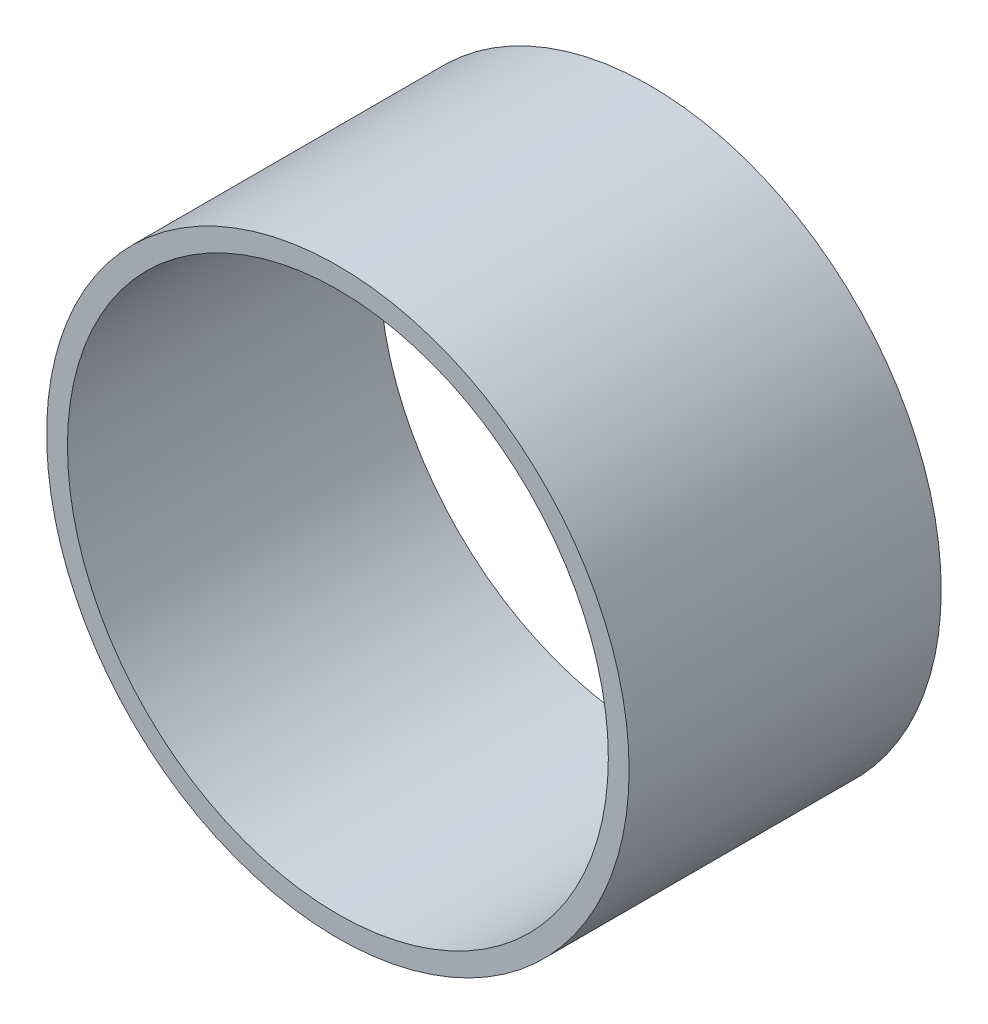
ISO-10303-21;
HEADER;
FILE_DESCRIPTION(('STEP AP214'),'2;1');
FILE_NAME('part.step','',(''),(''),'','','');
FILE_SCHEMA(('AUTOMOTIVE_DESIGN { 1 0 10303 214 1 1 1 1 }'));
ENDSEC;
DATA;
#1=APPLICATION_CONTEXT('core data for automotive mechanical design processes');
#2=APPLICATION_PROTOCOL_DEFINITION('international standard','automotive_design',2000,#1);
#3=PRODUCT_CONTEXT('',#1,'mechanical');
#4=PRODUCT('Part','Part','',(#3));
#5=PRODUCT_RELATED_PRODUCT_CATEGORY('part','',(#4));
#6=PRODUCT_DEFINITION_FORMATION('','',#4);
#7=PRODUCT_DEFINITION_CONTEXT('part definition',#1,'design');
#8=PRODUCT_DEFINITION('design','',#6,#7);
#9=PRODUCT_DEFINITION_SHAPE('','',#8);
#10=(LENGTH_UNIT() NAMED_UNIT(*) SI_UNIT(.MILLI.,.METRE.));
#11=(NAMED_UNIT(*) PLANE_ANGLE_UNIT() SI_UNIT($,.RADIAN.));
#12=(NAMED_UNIT(*) SI_UNIT($,.STERADIAN.) SOLID_ANGLE_UNIT());
#13=UNCERTAINTY_MEASURE_WITH_UNIT(LENGTH_MEASURE(1.E-05),#10,'distance_accuracy_value','');
#14=(GEOMETRIC_REPRESENTATION_CONTEXT(3) GLOBAL_UNCERTAINTY_ASSIGNED_CONTEXT((#13)) GLOBAL_UNIT_ASSIGNED_CONTEXT((#10,
#11,#12)) REPRESENTATION_CONTEXT('',''));
#15=CARTESIAN_POINT('',(0.,0.,0.));
#16=DIRECTION('',(0.,0.,1.));
#17=DIRECTION('',(1.,0.,0.));
#18=AXIS2_PLACEMENT_3D('',#15,#16,#17);
#19=CARTESIAN_POINT('',(0.,0.,15.));
#20=DIRECTION('',(0.,0.,1.));
#21=DIRECTION('',(1.,0.,0.));
#22=AXIS2_PLACEMENT_3D('',#19,#20,#21);
#23=PLANE('',#22);
#24=CARTESIAN_POINT('',(0.,0.,15.));
#25=DIRECTION('',(0.,0.,1.));
#26=DIRECTION('',(1.,0.,0.));
#27=AXIS2_PLACEMENT_3D('',#24,#25,#26);
#28=CIRCLE('',#27,14.);
#29=CARTESIAN_POINT('',(14.,0.,15.));
#30=VERTEX_POINT('',#29);
#31=EDGE_CURVE('E10',#30,#30,#28,.T.);
#32=ORIENTED_EDGE('',*,*,#31,.T.);
#33=EDGE_LOOP('',(#32));
#34=FACE_BOUND('',#33,.T.);
#35=CARTESIAN_POINT('',(0.,0.,15.));
#36=DIRECTION('',(0.,0.,1.));
#37=DIRECTION('',(1.,0.,0.));
#38=AXIS2_PLACEMENT_3D('',#35,#36,#37);
#39=CIRCLE('',#38,13.);
#40=CARTESIAN_POINT('',(13.,0.,15.));
#41=VERTEX_POINT('',#40);
#42=EDGE_CURVE('E48',#41,#41,#39,.T.);
#43=ORIENTED_EDGE('',*,*,#42,.F.);
#44=EDGE_LOOP('',(#43));
#45=FACE_BOUND('',#44,.T.);
#46=ADVANCED_FACE('F37',(#34,#45),#23,.T.);
#47=CARTESIAN_POINT('',(0.,0.,0.));
#48=DIRECTION('',(0.,0.,1.));
#49=DIRECTION('',(1.,0.,0.));
#50=AXIS2_PLACEMENT_3D('',#47,#48,#49);
#51=PLANE('',#50);
#52=CARTESIAN_POINT('',(0.,0.,0.));
#53=DIRECTION('',(0.,0.,1.));
#54=DIRECTION('',(1.,0.,0.));
#55=AXIS2_PLACEMENT_3D('',#52,#53,#54);
#56=CIRCLE('',#55,14.);
#57=CARTESIAN_POINT('',(14.,0.,0.));
#58=VERTEX_POINT('',#57);
#59=EDGE_CURVE('E41',#58,#58,#56,.T.);
#60=ORIENTED_EDGE('',*,*,#59,.F.);
#61=EDGE_LOOP('',(#60));
#62=FACE_BOUND('',#61,.T.);
#63=CARTESIAN_POINT('',(0.,0.,0.));
#64=DIRECTION('',(0.,0.,1.));
#65=DIRECTION('',(1.,0.,0.));
#66=AXIS2_PLACEMENT_3D('',#63,#64,#65);
#67=CIRCLE('',#66,13.);
#68=CARTESIAN_POINT('',(13.,0.,0.));
#69=VERTEX_POINT('',#68);
#70=EDGE_CURVE('E50',#69,#69,#67,.T.);
#71=ORIENTED_EDGE('',*,*,#70,.T.);
#72=EDGE_LOOP('',(#71));
#73=FACE_BOUND('',#72,.T.);
#74=ADVANCED_FACE('F60',(#62,#73),#51,.F.);
#75=CARTESIAN_POINT('',(0.,0.,15.));
#76=DIRECTION('',(0.,0.,-1.));
#77=DIRECTION('',(-1.,0.,0.));
#78=AXIS2_PLACEMENT_3D('',#75,#76,#77);
#79=CYLINDRICAL_SURFACE('',#78,14.);
#80=ORIENTED_EDGE('',*,*,#31,.F.);
#81=EDGE_LOOP('',(#80));
#82=FACE_BOUND('',#81,.T.);
#83=ORIENTED_EDGE('',*,*,#59,.T.);
#84=EDGE_LOOP('',(#83));
#85=FACE_BOUND('',#84,.T.);
#86=ADVANCED_FACE('F39',(#82,#85),#79,.T.);
#87=CARTESIAN_POINT('',(0.,0.,15.));
#88=DIRECTION('',(0.,0.,-1.));
#89=DIRECTION('',(-1.,0.,0.));
#90=AXIS2_PLACEMENT_3D('',#87,#88,#89);
#91=CYLINDRICAL_SURFACE('',#90,13.);
#92=ORIENTED_EDGE('',*,*,#42,.T.);
#93=EDGE_LOOP('',(#92));
#94=FACE_BOUND('',#93,.T.);
#95=ORIENTED_EDGE('',*,*,#70,.F.);
#96=EDGE_LOOP('',(#95));
#97=FACE_BOUND('',#96,.T.);
#98=ADVANCED_FACE('F56',(#94,#97),#91,.F.);
#99=CLOSED_SHELL('',(#46,#74,#86,#98));
#100=MANIFOLD_SOLID_BREP('B2',#99);
#101=ADVANCED_BREP_SHAPE_REPRESENTATION('',(#18,#100),#14);
#102=SHAPE_DEFINITION_REPRESENTATION(#9,#101);
ENDSEC;
END-ISO-10303-21;
